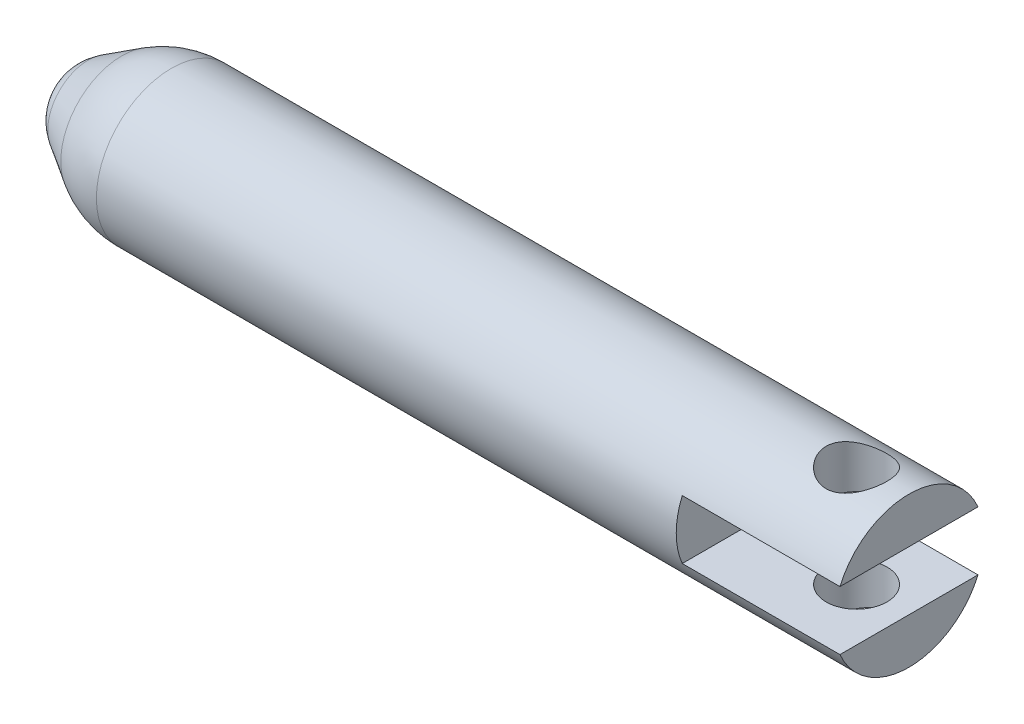
ISO-10303-21;
HEADER;
FILE_DESCRIPTION(('STEP AP214'),'2;1');
FILE_NAME('part.step','',(''),(''),'','','');
FILE_SCHEMA(('AUTOMOTIVE_DESIGN { 1 0 10303 214 1 1 1 1 }'));
ENDSEC;
DATA;
#1=APPLICATION_CONTEXT('core data for automotive mechanical design processes');
#2=APPLICATION_PROTOCOL_DEFINITION('international standard','automotive_design',2000,#1);
#3=PRODUCT_CONTEXT('',#1,'mechanical');
#4=PRODUCT('Part','Part','',(#3));
#5=PRODUCT_RELATED_PRODUCT_CATEGORY('part','',(#4));
#6=PRODUCT_DEFINITION_FORMATION('','',#4);
#7=PRODUCT_DEFINITION_CONTEXT('part definition',#1,'design');
#8=PRODUCT_DEFINITION('design','',#6,#7);
#9=PRODUCT_DEFINITION_SHAPE('','',#8);
#10=(LENGTH_UNIT() NAMED_UNIT(*) SI_UNIT(.MILLI.,.METRE.));
#11=(NAMED_UNIT(*) PLANE_ANGLE_UNIT() SI_UNIT($,.RADIAN.));
#12=(NAMED_UNIT(*) SI_UNIT($,.STERADIAN.) SOLID_ANGLE_UNIT());
#13=UNCERTAINTY_MEASURE_WITH_UNIT(LENGTH_MEASURE(1.E-05),#10,'distance_accuracy_value','');
#14=(GEOMETRIC_REPRESENTATION_CONTEXT(3) GLOBAL_UNCERTAINTY_ASSIGNED_CONTEXT((#13)) GLOBAL_UNIT_ASSIGNED_CONTEXT((#10,
#11,#12)) REPRESENTATION_CONTEXT('',''));
#15=CARTESIAN_POINT('',(0.,0.,0.));
#16=DIRECTION('',(0.,0.,1.));
#17=DIRECTION('',(1.,0.,0.));
#18=AXIS2_PLACEMENT_3D('',#15,#16,#17);
#19=CARTESIAN_POINT('',(-19.7055672345442,-0.00660798549655371,0.));
#20=DIRECTION('',(0.,0.,-1.));
#21=DIRECTION('',(0.,-1.,0.));
#22=AXIS2_PLACEMENT_3D('',#19,#20,#21);
#23=CIRCLE('',#22,2.48944153560534);
#24=TRIMMED_CURVE('',#23,(PARAMETER_VALUE(-1.57345073468594)),
(PARAMETER_VALUE(1.57345073468594)),.T.,.PARAMETER.);
#25=CARTESIAN_POINT('',(-19.7055672345442,0.,0.));
#26=DIRECTION('',(-1.,0.,0.));
#27=AXIS1_PLACEMENT('',#25,#26);
#28=SURFACE_OF_REVOLUTION('',#24,#27);
#29=CARTESIAN_POINT('',(-22.195,0.,0.));
#30=VERTEX_POINT('',#29);
#31=VERTEX_LOOP('',#30);
#32=FACE_BOUND('',#31,.T.);
#33=CARTESIAN_POINT('',(-21.0050000000024,0.,0.));
#34=DIRECTION('',(1.,0.,0.));
#35=DIRECTION('',(0.,0.,-1.));
#36=AXIS2_PLACEMENT_3D('',#33,#34,#35);
#37=CIRCLE('',#36,2.12999999996555);
#38=CARTESIAN_POINT('',(-21.0050000000024,0.,-2.12999999996555));
#39=VERTEX_POINT('',#38);
#40=EDGE_CURVE('E96',#39,#39,#37,.T.);
#41=ORIENTED_EDGE('',*,*,#40,.F.);
#42=EDGE_LOOP('',(#41));
#43=FACE_BOUND('',#42,.T.);
#44=ADVANCED_FACE('F16',(#32,#43),#28,.T.);
#45=CARTESIAN_POINT('',(13.895,-1.55,4.94911369346105));
#46=DIRECTION('',(1.,0.,0.));
#47=DIRECTION('',(0.,0.,-1.));
#48=AXIS2_PLACEMENT_3D('',#45,#46,#47);
#49=PLANE('',#48);
#50=CARTESIAN_POINT('',(13.895,0.,0.));
#51=DIRECTION('',(-1.,0.,0.));
#52=DIRECTION('',(0.,0.,1.));
#53=AXIS2_PLACEMENT_3D('',#50,#51,#52);
#54=CIRCLE('',#53,3.95);
#55=CARTESIAN_POINT('',(13.895,1.55,3.63318042491699));
#56=VERTEX_POINT('',#55);
#57=CARTESIAN_POINT('',(13.895,-1.55,3.63318042491699));
#58=VERTEX_POINT('',#57);
#59=EDGE_CURVE('E35',#56,#58,#54,.F.);
#60=ORIENTED_EDGE('',*,*,#59,.T.);
#61=DIRECTION('',(0.,0.,-1.));
#62=VECTOR('',#61,1.);
#63=CARTESIAN_POINT('',(13.895,-1.55,4.94911369346105));
#64=LINE('',#63,#62);
#65=CARTESIAN_POINT('',(13.895,-1.55,-3.63318042491699));
#66=VERTEX_POINT('',#65);
#67=EDGE_CURVE('E74',#58,#66,#64,.T.);
#68=ORIENTED_EDGE('',*,*,#67,.T.);
#69=CARTESIAN_POINT('',(13.895,0.,0.));
#70=DIRECTION('',(-1.,0.,0.));
#71=DIRECTION('',(0.,0.,1.));
#72=AXIS2_PLACEMENT_3D('',#69,#70,#71);
#73=CIRCLE('',#72,3.95);
#74=CARTESIAN_POINT('',(13.895,1.55,-3.63318042491699));
#75=VERTEX_POINT('',#74);
#76=EDGE_CURVE('E20',#66,#75,#73,.F.);
#77=ORIENTED_EDGE('',*,*,#76,.T.);
#78=DIRECTION('',(0.,0.,1.));
#79=VECTOR('',#78,1.);
#80=CARTESIAN_POINT('',(13.895,1.55,4.94911369346105));
#81=LINE('',#80,#79);
#82=EDGE_CURVE('E107',#75,#56,#81,.T.);
#83=ORIENTED_EDGE('',*,*,#82,.T.);
#84=EDGE_LOOP('',(#60,#68,#77,#83));
#85=FACE_BOUND('',#84,.T.);
#86=ADVANCED_FACE('F75',(#85),#49,.T.);
#87=CARTESIAN_POINT('',(19.435,3.95,0.));
#88=DIRECTION('',(0.,-1.,0.));
#89=DIRECTION('',(0.,0.,-1.));
#90=AXIS2_PLACEMENT_3D('',#87,#88,#89);
#91=CYLINDRICAL_SURFACE('',#90,1.6);
#92=CARTESIAN_POINT('',(19.435,1.55,0.));
#93=DIRECTION('',(0.,-1.,0.));
#94=DIRECTION('',(0.,0.,-1.));
#95=AXIS2_PLACEMENT_3D('',#92,#93,#94);
#96=CIRCLE('',#95,1.6);
#97=CARTESIAN_POINT('',(19.435,1.55,-1.6));
#98=VERTEX_POINT('',#97);
#99=EDGE_CURVE('E100',#98,#98,#96,.T.);
#100=ORIENTED_EDGE('',*,*,#99,.T.);
#101=EDGE_LOOP('',(#100));
#102=FACE_BOUND('',#101,.T.);
#103=CARTESIAN_POINT('',(19.435,3.61144015594887,1.6));
#104=CARTESIAN_POINT('',(19.3493224597279,3.61144560159579,1.59999470370209));
#105=CARTESIAN_POINT('',(19.2635695219037,3.61452951904238,1.59308236127239));
#106=CARTESIAN_POINT('',(19.0945976576518,3.62646300542946,1.5657191872912));
#107=CARTESIAN_POINT('',(19.0113827292107,3.6353212242095,1.54524804406528));
#108=CARTESIAN_POINT('',(18.8501217256063,3.65762490488302,1.49168080234136));
#109=CARTESIAN_POINT('',(18.7720589115027,3.67105453964907,1.45862821715702));
#110=CARTESIAN_POINT('',(18.6225817551753,3.70096588662584,1.38096943715101));
#111=CARTESIAN_POINT('',(18.5511678046523,3.7174477784817,1.33636256222264));
#112=CARTESIAN_POINT('',(18.4128175385643,3.75268470848712,1.23407082949042));
#113=CARTESIAN_POINT('',(18.3463204870442,3.7715139843555,1.17581720651003));
#114=CARTESIAN_POINT('',(18.2237212143267,3.80871082576605,1.04908544890429));
#115=CARTESIAN_POINT('',(18.1676220591118,3.82707825374958,0.980604309250075));
#116=CARTESIAN_POINT('',(18.0652022066809,3.86217995716578,0.831939938107691));
#117=CARTESIAN_POINT('',(18.0193714212843,3.87881755567951,0.75139429704403));
#118=CARTESIAN_POINT('',(17.9420979801485,3.9076803894409,0.582940655240961));
#119=CARTESIAN_POINT('',(17.91064946757,3.91990742035828,0.495035668704348));
#120=CARTESIAN_POINT('',(17.8646121297836,3.93804426276585,0.318976352520622));
#121=CARTESIAN_POINT('',(17.8492656373741,3.94423688026524,0.231049864881464));
#122=CARTESIAN_POINT('',(17.833425652868,3.95063087128678,0.0536661236460584));
#123=CARTESIAN_POINT('',(17.832926495341,3.95083453006913,-0.0357905330319927));
#124=CARTESIAN_POINT('',(17.8463855651409,3.94539803491137,-0.208209419527452));
#125=CARTESIAN_POINT('',(17.8595130483755,3.94009366936905,-0.291249023919192));
#126=CARTESIAN_POINT('',(17.8984364328559,3.92469230559964,-0.453829206175721));
#127=CARTESIAN_POINT('',(17.924233265844,3.91459495488375,-0.533369526223704));
#128=CARTESIAN_POINT('',(17.9880778660854,3.89039853198288,-0.688137018571472));
#129=CARTESIAN_POINT('',(18.0263054352595,3.87624111222595,-0.763280519320643));
#130=CARTESIAN_POINT('',(18.1137543980992,3.84532435834271,-0.906278311595202));
#131=CARTESIAN_POINT('',(18.1629791987051,3.82856421838581,-0.974130334553673));
#132=CARTESIAN_POINT('',(18.2748663490752,3.79281123125318,-1.10545037549208));
#133=CARTESIAN_POINT('',(18.3382079933247,3.77374402886461,-1.16832017820915));
#134=CARTESIAN_POINT('',(18.4746215037249,3.73637917279259,-1.28281211622479));
#135=CARTESIAN_POINT('',(18.547699348392,3.718082001104,-1.33442728885479));
#136=CARTESIAN_POINT('',(18.7042769833077,3.68380936256095,-1.42637091734714));
#137=CARTESIAN_POINT('',(18.7880250695219,3.66792081487238,-1.46631095200621));
#138=CARTESIAN_POINT('',(18.9617976604575,3.64130601732329,-1.53122187095572));
#139=CARTESIAN_POINT('',(19.0518081196773,3.63056861607679,-1.55622511999753));
#140=CARTESIAN_POINT('',(19.1914382234863,3.61932527447728,-1.58210842768194));
#141=CARTESIAN_POINT('',(19.2398518123396,3.61638199575275,-1.58880623856321));
#142=CARTESIAN_POINT('',(19.3371687415396,3.61243789246375,-1.59775351204141));
#143=CARTESIAN_POINT('',(19.3860720763839,3.61143704610006,-1.60000302455998));
#144=CARTESIAN_POINT('',(19.5206775402721,3.61144560159579,-1.59999470370209));
#145=CARTESIAN_POINT('',(19.6064304780963,3.61452951904238,-1.59308236127239));
#146=CARTESIAN_POINT('',(19.7754023423482,3.62646300542946,-1.5657191872912));
#147=CARTESIAN_POINT('',(19.8586172707894,3.6353212242095,-1.54524804406528));
#148=CARTESIAN_POINT('',(20.0198782743938,3.65762490488302,-1.49168080234136));
#149=CARTESIAN_POINT('',(20.0979410884973,3.67105453964907,-1.45862821715703));
#150=CARTESIAN_POINT('',(20.2474182448247,3.70096588662584,-1.38096943715101));
#151=CARTESIAN_POINT('',(20.3188321953477,3.7174477784817,-1.33636256222264));
#152=CARTESIAN_POINT('',(20.4571824614357,3.75268470848712,-1.23407082949042));
#153=CARTESIAN_POINT('',(20.5236795129558,3.7715139843555,-1.17581720651003));
#154=CARTESIAN_POINT('',(20.6462787856733,3.80871082576605,-1.04908544890429));
#155=CARTESIAN_POINT('',(20.7023779408883,3.82707825374958,-0.980604309250075));
#156=CARTESIAN_POINT('',(20.8047977933191,3.86217995716578,-0.831939938107691));
#157=CARTESIAN_POINT('',(20.8506285787157,3.87881755567951,-0.75139429704403));
#158=CARTESIAN_POINT('',(20.9279020198515,3.9076803894409,-0.582940655240961));
#159=CARTESIAN_POINT('',(20.95935053243,3.91990742035828,-0.495035668704348));
#160=CARTESIAN_POINT('',(21.0053878702164,3.93804426276585,-0.318976352520622));
#161=CARTESIAN_POINT('',(21.0207343626259,3.94423688026524,-0.231049864881464));
#162=CARTESIAN_POINT('',(21.0365743471321,3.95063087128678,-0.0536661236460584));
#163=CARTESIAN_POINT('',(21.037073504659,3.95083453006913,0.0357905330319928));
#164=CARTESIAN_POINT('',(21.0236144348591,3.94539803491137,0.208209419527452));
#165=CARTESIAN_POINT('',(21.0104869516246,3.94009366936905,0.291249023919193));
#166=CARTESIAN_POINT('',(20.9715635671441,3.92469230559964,0.453829206175721));
#167=CARTESIAN_POINT('',(20.945766734156,3.91459495488375,0.533369526223704));
#168=CARTESIAN_POINT('',(20.8819221339146,3.89039853198288,0.688137018571472));
#169=CARTESIAN_POINT('',(20.8436945647405,3.87624111222595,0.763280519320643));
#170=CARTESIAN_POINT('',(20.7562456019008,3.84532435834271,0.906278311595202));
#171=CARTESIAN_POINT('',(20.7070208012949,3.82856421838581,0.974130334553673));
#172=CARTESIAN_POINT('',(20.5951336509248,3.79281123125318,1.10545037549208));
#173=CARTESIAN_POINT('',(20.5317920066753,3.77374402886461,1.16832017820915));
#174=CARTESIAN_POINT('',(20.3953784962751,3.73637917279259,1.28281211622479));
#175=CARTESIAN_POINT('',(20.322300651608,3.718082001104,1.33442728885479));
#176=CARTESIAN_POINT('',(20.1657230166923,3.68380936256095,1.42637091734714));
#177=CARTESIAN_POINT('',(20.0819749304782,3.66792081487238,1.46631095200621));
#178=CARTESIAN_POINT('',(19.9082023395425,3.64130601732329,1.53122187095572));
#179=CARTESIAN_POINT('',(19.8181918803227,3.63056861607679,1.55622511999753));
#180=CARTESIAN_POINT('',(19.6785617765137,3.61932527447728,1.58210842768194));
#181=CARTESIAN_POINT('',(19.6301481876604,3.61638199575275,1.58880623856321));
#182=CARTESIAN_POINT('',(19.5328312584604,3.61243789246375,1.59775351204141));
#183=CARTESIAN_POINT('',(19.4839279236161,3.61143704610006,1.60000302455998));
#184=CARTESIAN_POINT('',(19.435,3.61144015594887,1.6));
#185=B_SPLINE_CURVE_WITH_KNOTS('',3,(#103,#104,#105,#106,#107,#108,#109,#110,#111,#112,#113,
#114,#115,#116,#117,#118,#119,#120,#121,#122,#123,#124,#125,#126,#127,#128,#129,#130,#131,#132,
#133,#134,#135,#136,#137,#138,#139,#140,#141,#142,#143,#144,#145,#146,#147,#148,#149,#150,#151,
#152,#153,#154,#155,#156,#157,#158,#159,#160,#161,#162,#163,#164,#165,#166,#167,#168,#169,#170,
#171,#172,#173,#174,#175,#176,#177,#178,#179,#180,#181,#182,#183,#184),.UNSPECIFIED.,.T.,.F.,(4,
2,2,2,2,2,2,2,2,2,2,2,2,2,2,2,2,2,2,2,2,2,2,2,2,2,2,2,2,2,2,2,2,2,2,2,2,2,2,2,4),(0.,
0.256839661244886,0.514064952362313,0.770408587886219,1.02676731569676,1.29674171274575,
1.56679558976873,1.84782184546209,2.12873355775474,2.39573667853049,2.66263791523023,
2.91417203878336,3.16572466368802,3.4210909696143,3.67653649795255,3.94909496588572,
4.22182157649641,4.50279375518122,4.78315489931514,4.92983012271956,5.07650370003132,
5.33334336127621,5.59056865239363,5.84691228791754,6.10327101572808,6.37324541277707,
6.64329928980005,6.92432554549341,7.20523725778606,7.47224037856181,7.73914161526155,
7.99067573881468,8.24222836371933,8.49759466964561,8.75304019798387,9.02559866591703,
9.29832527652773,9.57929745521253,9.85965859934646,10.0063338227509,10.1530074000626),.UNSPECIFIED.);
#186=CARTESIAN_POINT('',(19.435,3.61144015594887,1.6));
#187=VERTEX_POINT('',#186);
#188=EDGE_CURVE('E79',#187,#187,#185,.T.);
#189=ORIENTED_EDGE('',*,*,#188,.F.);
#190=EDGE_LOOP('',(#189));
#191=FACE_BOUND('',#190,.T.);
#192=ADVANCED_FACE('F127',(#102,#191),#91,.F.);
#193=CARTESIAN_POINT('',(22.195,3.95,0.));
#194=DIRECTION('',(-1.,0.,0.));
#195=DIRECTION('',(0.,0.,1.));
#196=AXIS2_PLACEMENT_3D('',#193,#194,#195);
#197=PLANE('',#196);
#198=CARTESIAN_POINT('',(22.195,0.,0.));
#199=DIRECTION('',(-1.,0.,0.));
#200=DIRECTION('',(0.,0.,1.));
#201=AXIS2_PLACEMENT_3D('',#198,#199,#200);
#202=CIRCLE('',#201,3.95);
#203=CARTESIAN_POINT('',(22.195,1.55,3.63318042491699));
#204=VERTEX_POINT('',#203);
#205=CARTESIAN_POINT('',(22.195,1.55,-3.63318042491699));
#206=VERTEX_POINT('',#205);
#207=EDGE_CURVE('E104',#204,#206,#202,.T.);
#208=ORIENTED_EDGE('',*,*,#207,.F.);
#209=DIRECTION('',(0.,0.,1.));
#210=VECTOR('',#209,1.);
#211=CARTESIAN_POINT('',(22.195,1.55,4.94911369346105));
#212=LINE('',#211,#210);
#213=EDGE_CURVE('E61',#204,#206,#212,.F.);
#214=ORIENTED_EDGE('',*,*,#213,.T.);
#215=EDGE_LOOP('',(#208,#214));
#216=FACE_BOUND('',#215,.T.);
#217=ADVANCED_FACE('F132',(#216),#197,.F.);
#218=CARTESIAN_POINT('',(13.895,1.55,4.94911369346105));
#219=DIRECTION('',(0.,1.,0.));
#220=DIRECTION('',(0.,0.,1.));
#221=AXIS2_PLACEMENT_3D('',#218,#219,#220);
#222=PLANE('',#221);
#223=ORIENTED_EDGE('',*,*,#99,.F.);
#224=EDGE_LOOP('',(#223));
#225=FACE_BOUND('',#224,.T.);
#226=ORIENTED_EDGE('',*,*,#82,.F.);
#227=DIRECTION('',(-1.,0.,0.));
#228=VECTOR('',#227,1.);
#229=CARTESIAN_POINT('',(-29.5406094674223,1.55,-3.63318042491699));
#230=LINE('',#229,#228);
#231=EDGE_CURVE('E73',#206,#75,#230,.T.);
#232=ORIENTED_EDGE('',*,*,#231,.F.);
#233=ORIENTED_EDGE('',*,*,#213,.F.);
#234=DIRECTION('',(-1.,0.,0.));
#235=VECTOR('',#234,1.);
#236=CARTESIAN_POINT('',(-29.5406094674223,1.55,3.63318042491699));
#237=LINE('',#236,#235);
#238=EDGE_CURVE('E101',#56,#204,#237,.F.);
#239=ORIENTED_EDGE('',*,*,#238,.F.);
#240=EDGE_LOOP('',(#226,#232,#233,#239));
#241=FACE_BOUND('',#240,.T.);
#242=ADVANCED_FACE('F147',(#225,#241),#222,.F.);
#243=CARTESIAN_POINT('',(-19.2350000000943,0.,0.));
#244=DIRECTION('',(1.,0.,0.));
#245=DIRECTION('',(0.,0.,-1.));
#246=AXIS2_PLACEMENT_3D('',#243,#244,#245);
#247=CONICAL_SURFACE('',#246,3.21317069051474,0.549167849133404);
#248=ORIENTED_EDGE('',*,*,#40,.T.);
#249=EDGE_LOOP('',(#248));
#250=FACE_BOUND('',#249,.T.);
#251=CARTESIAN_POINT('',(-19.2350000000007,0.,0.));
#252=DIRECTION('',(1.,0.,0.));
#253=DIRECTION('',(0.,1.,0.));
#254=AXIS2_PLACEMENT_3D('',#251,#252,#253);
#255=CIRCLE('',#254,3.21317069064314);
#256=CARTESIAN_POINT('',(-19.2350000000007,3.21317069064314,0.));
#257=VERTEX_POINT('',#256);
#258=EDGE_CURVE('E90',#257,#257,#255,.T.);
#259=ORIENTED_EDGE('',*,*,#258,.F.);
#260=EDGE_LOOP('',(#259));
#261=FACE_BOUND('',#260,.T.);
#262=ADVANCED_FACE('F143',(#250,#261),#247,.T.);
#263=CARTESIAN_POINT('',(22.195,3.95,0.));
#264=DIRECTION('',(-1.,0.,0.));
#265=DIRECTION('',(0.,0.,1.));
#266=AXIS2_PLACEMENT_3D('',#263,#264,#265);
#267=PLANE('',#266);
#268=CARTESIAN_POINT('',(22.195,0.,0.));
#269=DIRECTION('',(-1.,0.,0.));
#270=DIRECTION('',(0.,0.,1.));
#271=AXIS2_PLACEMENT_3D('',#268,#269,#270);
#272=CIRCLE('',#271,3.95);
#273=CARTESIAN_POINT('',(22.195,-1.55,-3.63318042491699));
#274=VERTEX_POINT('',#273);
#275=CARTESIAN_POINT('',(22.195,-1.55,3.63318042491699));
#276=VERTEX_POINT('',#275);
#277=EDGE_CURVE('E84',#274,#276,#272,.T.);
#278=ORIENTED_EDGE('',*,*,#277,.F.);
#279=DIRECTION('',(0.,0.,-1.));
#280=VECTOR('',#279,1.);
#281=CARTESIAN_POINT('',(22.195,-1.55,4.94911369346105));
#282=LINE('',#281,#280);
#283=EDGE_CURVE('E80',#274,#276,#282,.F.);
#284=ORIENTED_EDGE('',*,*,#283,.T.);
#285=EDGE_LOOP('',(#278,#284));
#286=FACE_BOUND('',#285,.T.);
#287=ADVANCED_FACE('F146',(#286),#267,.F.);
#288=CARTESIAN_POINT('',(13.895,-1.55,4.94911369346105));
#289=DIRECTION('',(0.,-1.,0.));
#290=DIRECTION('',(0.,0.,-1.));
#291=AXIS2_PLACEMENT_3D('',#288,#289,#290);
#292=PLANE('',#291);
#293=CARTESIAN_POINT('',(19.435,-1.55,0.));
#294=DIRECTION('',(0.,-1.,0.));
#295=DIRECTION('',(0.,0.,-1.));
#296=AXIS2_PLACEMENT_3D('',#293,#294,#295);
#297=CIRCLE('',#296,1.6);
#298=CARTESIAN_POINT('',(19.435,-1.55,-1.6));
#299=VERTEX_POINT('',#298);
#300=EDGE_CURVE('E85',#299,#299,#297,.T.);
#301=ORIENTED_EDGE('',*,*,#300,.T.);
#302=EDGE_LOOP('',(#301));
#303=FACE_BOUND('',#302,.T.);
#304=ORIENTED_EDGE('',*,*,#67,.F.);
#305=DIRECTION('',(-1.,0.,0.));
#306=VECTOR('',#305,1.);
#307=CARTESIAN_POINT('',(-29.5406094674223,-1.55,3.63318042491699));
#308=LINE('',#307,#306);
#309=EDGE_CURVE('E87',#276,#58,#308,.T.);
#310=ORIENTED_EDGE('',*,*,#309,.F.);
#311=ORIENTED_EDGE('',*,*,#283,.F.);
#312=DIRECTION('',(-1.,0.,0.));
#313=VECTOR('',#312,1.);
#314=CARTESIAN_POINT('',(-29.5406094674223,-1.55,-3.63318042491699));
#315=LINE('',#314,#313);
#316=EDGE_CURVE('E71',#66,#274,#315,.F.);
#317=ORIENTED_EDGE('',*,*,#316,.F.);
#318=EDGE_LOOP('',(#304,#310,#311,#317));
#319=FACE_BOUND('',#318,.T.);
#320=ADVANCED_FACE('F82',(#303,#319),#292,.F.);
#321=CARTESIAN_POINT('',(-16.6224569522205,0.,0.));
#322=DIRECTION('',(-1.,0.,0.));
#323=DIRECTION('',(0.,-1.,0.));
#324=AXIS2_PLACEMENT_3D('',#321,#322,#323);
#325=DEGENERATE_TOROIDAL_SURFACE('',#324,1.04999935329082,5.00000000000006,.F.);
#326=CARTESIAN_POINT('',(-16.625,0.,0.));
#327=DIRECTION('',(-1.,0.,0.));
#328=DIRECTION('',(0.,0.,1.));
#329=AXIS2_PLACEMENT_3D('',#326,#327,#328);
#330=CIRCLE('',#329,3.95);
#331=CARTESIAN_POINT('',(-16.625,0.,3.95));
#332=VERTEX_POINT('',#331);
#333=EDGE_CURVE('E26',#332,#332,#330,.F.);
#334=ORIENTED_EDGE('',*,*,#333,.F.);
#335=EDGE_LOOP('',(#334));
#336=FACE_BOUND('',#335,.T.);
#337=ORIENTED_EDGE('',*,*,#258,.T.);
#338=EDGE_LOOP('',(#337));
#339=FACE_BOUND('',#338,.T.);
#340=ADVANCED_FACE('F18',(#336,#339),#325,.F.);
#341=CARTESIAN_POINT('',(19.435,3.95,0.));
#342=DIRECTION('',(0.,-1.,0.));
#343=DIRECTION('',(0.,0.,-1.));
#344=AXIS2_PLACEMENT_3D('',#341,#342,#343);
#345=CYLINDRICAL_SURFACE('',#344,1.6);
#346=ORIENTED_EDGE('',*,*,#300,.F.);
#347=EDGE_LOOP('',(#346));
#348=FACE_BOUND('',#347,.T.);
#349=CARTESIAN_POINT('',(19.435,-3.61144015594887,-1.6));
#350=CARTESIAN_POINT('',(19.3493224597279,-3.61144560159579,-1.59999470370209));
#351=CARTESIAN_POINT('',(19.2635695219037,-3.61452951904238,-1.59308236127239));
#352=CARTESIAN_POINT('',(19.0945976576518,-3.62646300542946,-1.5657191872912));
#353=CARTESIAN_POINT('',(19.0113827292107,-3.6353212242095,-1.54524804406528));
#354=CARTESIAN_POINT('',(18.8501217256063,-3.65762490488302,-1.49168080234136));
#355=CARTESIAN_POINT('',(18.7720589115027,-3.67105453964907,-1.45862821715702));
#356=CARTESIAN_POINT('',(18.6225817551753,-3.70096588662584,-1.38096943715101));
#357=CARTESIAN_POINT('',(18.5511678046523,-3.7174477784817,-1.33636256222264));
#358=CARTESIAN_POINT('',(18.4128175385643,-3.75268470848712,-1.23407082949042));
#359=CARTESIAN_POINT('',(18.3463204870442,-3.7715139843555,-1.17581720651003));
#360=CARTESIAN_POINT('',(18.2237212143267,-3.80871082576605,-1.04908544890429));
#361=CARTESIAN_POINT('',(18.1676220591118,-3.82707825374958,-0.980604309250075));
#362=CARTESIAN_POINT('',(18.0652022066809,-3.86217995716578,-0.831939938107691));
#363=CARTESIAN_POINT('',(18.0193714212843,-3.87881755567951,-0.75139429704403));
#364=CARTESIAN_POINT('',(17.9420979801485,-3.9076803894409,-0.582940655240961));
#365=CARTESIAN_POINT('',(17.91064946757,-3.91990742035828,-0.495035668704348));
#366=CARTESIAN_POINT('',(17.8646121297836,-3.93804426276585,-0.318976352520622));
#367=CARTESIAN_POINT('',(17.8492656373741,-3.94423688026524,-0.231049864881463));
#368=CARTESIAN_POINT('',(17.833425652868,-3.95063087128678,-0.0536661236460581));
#369=CARTESIAN_POINT('',(17.832926495341,-3.95083453006913,0.0357905330319929));
#370=CARTESIAN_POINT('',(17.8463855651409,-3.94539803491137,0.208209419527452));
#371=CARTESIAN_POINT('',(17.8595130483755,-3.94009366936905,0.291249023919192));
#372=CARTESIAN_POINT('',(17.8984364328559,-3.92469230559964,0.453829206175721));
#373=CARTESIAN_POINT('',(17.924233265844,-3.91459495488375,0.533369526223704));
#374=CARTESIAN_POINT('',(17.9880778660854,-3.89039853198288,0.688137018571472));
#375=CARTESIAN_POINT('',(18.0263054352595,-3.87624111222595,0.763280519320643));
#376=CARTESIAN_POINT('',(18.1137543980992,-3.84532435834271,0.906278311595202));
#377=CARTESIAN_POINT('',(18.1629791987051,-3.82856421838581,0.974130334553673));
#378=CARTESIAN_POINT('',(18.2748663490752,-3.79281123125318,1.10545037549208));
#379=CARTESIAN_POINT('',(18.3382079933247,-3.77374402886461,1.16832017820915));
#380=CARTESIAN_POINT('',(18.4746215037249,-3.73637917279259,1.28281211622479));
#381=CARTESIAN_POINT('',(18.547699348392,-3.718082001104,1.33442728885479));
#382=CARTESIAN_POINT('',(18.7042769833077,-3.68380936256095,1.42637091734714));
#383=CARTESIAN_POINT('',(18.7880250695219,-3.66792081487238,1.46631095200621));
#384=CARTESIAN_POINT('',(18.9617976604575,-3.64130601732329,1.53122187095572));
#385=CARTESIAN_POINT('',(19.0518081196773,-3.63056861607679,1.55622511999753));
#386=CARTESIAN_POINT('',(19.1914382234863,-3.61932527447728,1.58210842768194));
#387=CARTESIAN_POINT('',(19.2398518123396,-3.61638199575275,1.58880623856321));
#388=CARTESIAN_POINT('',(19.3371687415396,-3.61243789246375,1.59775351204141));
#389=CARTESIAN_POINT('',(19.3860720763839,-3.61143704610006,1.60000302455998));
#390=CARTESIAN_POINT('',(19.5206775402721,-3.61144560159579,1.59999470370209));
#391=CARTESIAN_POINT('',(19.6064304780963,-3.61452951904238,1.59308236127239));
#392=CARTESIAN_POINT('',(19.7754023423482,-3.62646300542946,1.5657191872912));
#393=CARTESIAN_POINT('',(19.8586172707894,-3.6353212242095,1.54524804406528));
#394=CARTESIAN_POINT('',(20.0198782743938,-3.65762490488301,1.49168080234136));
#395=CARTESIAN_POINT('',(20.0979410884973,-3.67105453964907,1.45862821715702));
#396=CARTESIAN_POINT('',(20.2474182448247,-3.70096588662584,1.38096943715101));
#397=CARTESIAN_POINT('',(20.3188321953477,-3.7174477784817,1.33636256222264));
#398=CARTESIAN_POINT('',(20.4571824614357,-3.75268470848712,1.23407082949042));
#399=CARTESIAN_POINT('',(20.5236795129558,-3.7715139843555,1.17581720651003));
#400=CARTESIAN_POINT('',(20.6462787856733,-3.80871082576605,1.04908544890429));
#401=CARTESIAN_POINT('',(20.7023779408883,-3.82707825374958,0.980604309250075));
#402=CARTESIAN_POINT('',(20.8047977933191,-3.86217995716578,0.831939938107691));
#403=CARTESIAN_POINT('',(20.8506285787157,-3.87881755567951,0.75139429704403));
#404=CARTESIAN_POINT('',(20.9279020198515,-3.9076803894409,0.582940655240961));
#405=CARTESIAN_POINT('',(20.95935053243,-3.91990742035828,0.495035668704348));
#406=CARTESIAN_POINT('',(21.0053878702164,-3.93804426276585,0.318976352520622));
#407=CARTESIAN_POINT('',(21.0207343626259,-3.94423688026524,0.231049864881463));
#408=CARTESIAN_POINT('',(21.0365743471321,-3.95063087128678,0.0536661236460584));
#409=CARTESIAN_POINT('',(21.037073504659,-3.95083453006913,-0.0357905330319927));
#410=CARTESIAN_POINT('',(21.0236144348591,-3.94539803491137,-0.208209419527452));
#411=CARTESIAN_POINT('',(21.0104869516246,-3.94009366936905,-0.291249023919192));
#412=CARTESIAN_POINT('',(20.9715635671441,-3.92469230559964,-0.453829206175721));
#413=CARTESIAN_POINT('',(20.945766734156,-3.91459495488375,-0.533369526223704));
#414=CARTESIAN_POINT('',(20.8819221339146,-3.89039853198288,-0.688137018571472));
#415=CARTESIAN_POINT('',(20.8436945647405,-3.87624111222595,-0.763280519320643));
#416=CARTESIAN_POINT('',(20.7562456019008,-3.84532435834271,-0.906278311595202));
#417=CARTESIAN_POINT('',(20.7070208012949,-3.82856421838581,-0.974130334553673));
#418=CARTESIAN_POINT('',(20.5951336509248,-3.79281123125318,-1.10545037549208));
#419=CARTESIAN_POINT('',(20.5317920066753,-3.77374402886461,-1.16832017820915));
#420=CARTESIAN_POINT('',(20.3953784962751,-3.73637917279259,-1.28281211622479));
#421=CARTESIAN_POINT('',(20.322300651608,-3.718082001104,-1.33442728885479));
#422=CARTESIAN_POINT('',(20.1657230166923,-3.68380936256095,-1.42637091734714));
#423=CARTESIAN_POINT('',(20.0819749304782,-3.66792081487238,-1.46631095200621));
#424=CARTESIAN_POINT('',(19.9082023395425,-3.64130601732329,-1.53122187095572));
#425=CARTESIAN_POINT('',(19.8181918803227,-3.63056861607679,-1.55622511999753));
#426=CARTESIAN_POINT('',(19.6785617765137,-3.61932527447728,-1.58210842768194));
#427=CARTESIAN_POINT('',(19.6301481876604,-3.61638199575275,-1.58880623856321));
#428=CARTESIAN_POINT('',(19.5328312584604,-3.61243789246375,-1.59775351204141));
#429=CARTESIAN_POINT('',(19.4839279236161,-3.61143704610006,-1.60000302455998));
#430=CARTESIAN_POINT('',(19.435,-3.61144015594887,-1.6));
#431=B_SPLINE_CURVE_WITH_KNOTS('',3,(#349,#350,#351,#352,#353,#354,#355,#356,#357,#358,#359,
#360,#361,#362,#363,#364,#365,#366,#367,#368,#369,#370,#371,#372,#373,#374,#375,#376,#377,#378,
#379,#380,#381,#382,#383,#384,#385,#386,#387,#388,#389,#390,#391,#392,#393,#394,#395,#396,#397,
#398,#399,#400,#401,#402,#403,#404,#405,#406,#407,#408,#409,#410,#411,#412,#413,#414,#415,#416,
#417,#418,#419,#420,#421,#422,#423,#424,#425,#426,#427,#428,#429,#430),.UNSPECIFIED.,.T.,.F.,(4,
2,2,2,2,2,2,2,2,2,2,2,2,2,2,2,2,2,2,2,2,2,2,2,2,2,2,2,2,2,2,2,2,2,2,2,2,2,2,2,4),(0.,
0.256839661244886,0.514064952362313,0.770408587886219,1.02676731569676,1.29674171274575,
1.56679558976873,1.84782184546209,2.12873355775474,2.39573667853049,2.66263791523023,
2.91417203878336,3.16572466368802,3.42109096961429,3.67653649795255,3.94909496588571,
4.22182157649641,4.50279375518122,4.78315489931514,4.92983012271956,5.07650370003132,
5.33334336127621,5.59056865239363,5.84691228791754,6.10327101572808,6.37324541277707,
6.64329928980005,6.92432554549341,7.20523725778606,7.47224037856181,7.73914161526155,
7.99067573881468,8.24222836371933,8.49759466964561,8.75304019798387,9.02559866591703,
9.29832527652773,9.57929745521253,9.85965859934646,10.0063338227509,10.1530074000626),.UNSPECIFIED.);
#432=CARTESIAN_POINT('',(19.435,-3.61144015594887,-1.6));
#433=VERTEX_POINT('',#432);
#434=EDGE_CURVE('E11',#433,#433,#431,.T.);
#435=ORIENTED_EDGE('',*,*,#434,.F.);
#436=EDGE_LOOP('',(#435));
#437=FACE_BOUND('',#436,.T.);
#438=ADVANCED_FACE('F113',(#348,#437),#345,.F.);
#439=CARTESIAN_POINT('',(-29.5406094674223,0.,0.));
#440=DIRECTION('',(-1.,0.,0.));
#441=DIRECTION('',(0.,0.,1.));
#442=AXIS2_PLACEMENT_3D('',#439,#440,#441);
#443=CYLINDRICAL_SURFACE('',#442,3.95);
#444=ORIENTED_EDGE('',*,*,#76,.F.);
#445=ORIENTED_EDGE('',*,*,#316,.T.);
#446=ORIENTED_EDGE('',*,*,#277,.T.);
#447=ORIENTED_EDGE('',*,*,#309,.T.);
#448=ORIENTED_EDGE('',*,*,#59,.F.);
#449=ORIENTED_EDGE('',*,*,#238,.T.);
#450=ORIENTED_EDGE('',*,*,#207,.T.);
#451=ORIENTED_EDGE('',*,*,#231,.T.);
#452=EDGE_LOOP('',(#444,#445,#446,#447,#448,#449,#450,#451));
#453=FACE_BOUND('',#452,.T.);
#454=ORIENTED_EDGE('',*,*,#434,.T.);
#455=EDGE_LOOP('',(#454));
#456=FACE_BOUND('',#455,.T.);
#457=ORIENTED_EDGE('',*,*,#333,.T.);
#458=EDGE_LOOP('',(#457));
#459=FACE_BOUND('',#458,.T.);
#460=ORIENTED_EDGE('',*,*,#188,.T.);
#461=EDGE_LOOP('',(#460));
#462=FACE_BOUND('',#461,.T.);
#463=ADVANCED_FACE('F67',(#453,#456,#459,#462),#443,.T.);
#464=CLOSED_SHELL('',(#44,#86,#192,#217,#242,#262,#287,#320,#340,#438,#463));
#465=MANIFOLD_SOLID_BREP('B1',#464);
#466=ADVANCED_BREP_SHAPE_REPRESENTATION('',(#18,#465),#14);
#467=SHAPE_DEFINITION_REPRESENTATION(#9,#466);
ENDSEC;
END-ISO-10303-21;
